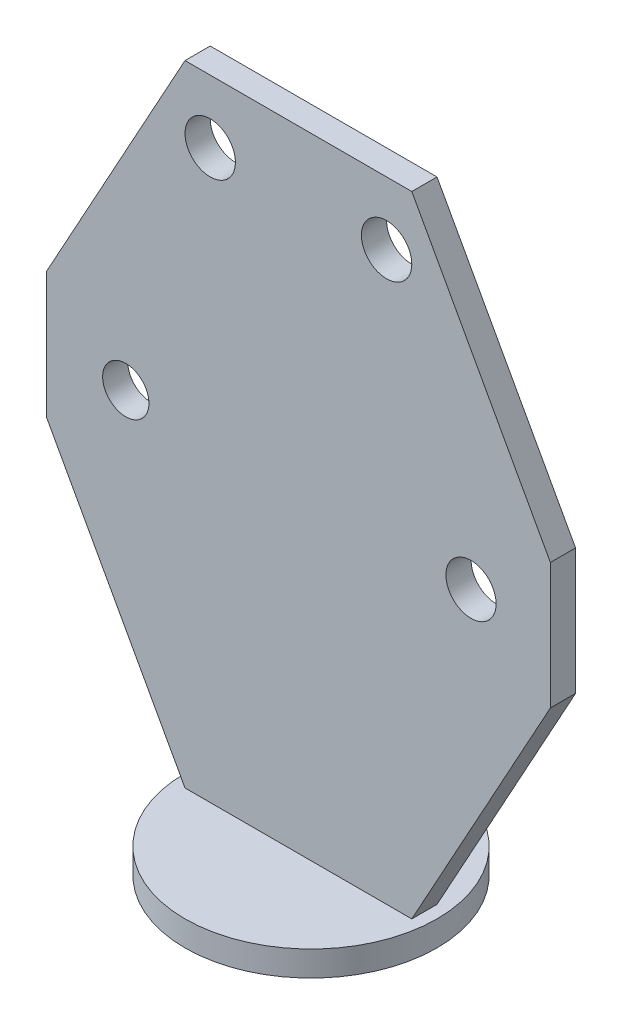
ISO-10303-21;
HEADER;
FILE_DESCRIPTION(('STEP AP214'),'2;1');
FILE_NAME('part.step','',(''),(''),'','','');
FILE_SCHEMA(('AUTOMOTIVE_DESIGN { 1 0 10303 214 1 1 1 1 }'));
ENDSEC;
DATA;
#1=APPLICATION_CONTEXT('core data for automotive mechanical design processes');
#2=APPLICATION_PROTOCOL_DEFINITION('international standard','automotive_design',2000,#1);
#3=PRODUCT_CONTEXT('',#1,'mechanical');
#4=PRODUCT('Part','Part','',(#3));
#5=PRODUCT_RELATED_PRODUCT_CATEGORY('part','',(#4));
#6=PRODUCT_DEFINITION_FORMATION('','',#4);
#7=PRODUCT_DEFINITION_CONTEXT('part definition',#1,'design');
#8=PRODUCT_DEFINITION('design','',#6,#7);
#9=PRODUCT_DEFINITION_SHAPE('','',#8);
#10=(LENGTH_UNIT() NAMED_UNIT(*) SI_UNIT(.MILLI.,.METRE.));
#11=(NAMED_UNIT(*) PLANE_ANGLE_UNIT() SI_UNIT($,.RADIAN.));
#12=(NAMED_UNIT(*) SI_UNIT($,.STERADIAN.) SOLID_ANGLE_UNIT());
#13=UNCERTAINTY_MEASURE_WITH_UNIT(LENGTH_MEASURE(1.E-05),#10,'distance_accuracy_value','');
#14=(GEOMETRIC_REPRESENTATION_CONTEXT(3) GLOBAL_UNCERTAINTY_ASSIGNED_CONTEXT((#13)) GLOBAL_UNIT_ASSIGNED_CONTEXT((#10,
#11,#12)) REPRESENTATION_CONTEXT('',''));
#15=CARTESIAN_POINT('',(0.,0.,0.));
#16=DIRECTION('',(0.,0.,1.));
#17=DIRECTION('',(1.,0.,0.));
#18=AXIS2_PLACEMENT_3D('',#15,#16,#17);
#19=CARTESIAN_POINT('',(0.,2.,0.));
#20=DIRECTION('',(0.,-1.,0.));
#21=DIRECTION('',(0.,0.,-1.));
#22=AXIS2_PLACEMENT_3D('',#19,#20,#21);
#23=CYLINDRICAL_SURFACE('',#22,10.);
#24=CARTESIAN_POINT('',(0.,2.,0.));
#25=DIRECTION('',(0.,1.,0.));
#26=DIRECTION('',(0.,0.,1.));
#27=AXIS2_PLACEMENT_3D('',#24,#25,#26);
#28=CIRCLE('',#27,10.);
#29=CARTESIAN_POINT('',(0.,2.,10.));
#30=VERTEX_POINT('',#29);
#31=EDGE_CURVE('E11',#30,#30,#28,.T.);
#32=ORIENTED_EDGE('',*,*,#31,.F.);
#33=EDGE_LOOP('',(#32));
#34=FACE_BOUND('',#33,.T.);
#35=CARTESIAN_POINT('',(0.,0.,0.));
#36=DIRECTION('',(0.,1.,0.));
#37=DIRECTION('',(0.,0.,1.));
#38=AXIS2_PLACEMENT_3D('',#35,#36,#37);
#39=CIRCLE('',#38,10.);
#40=CARTESIAN_POINT('',(0.,0.,10.));
#41=VERTEX_POINT('',#40);
#42=EDGE_CURVE('E39',#41,#41,#39,.T.);
#43=ORIENTED_EDGE('',*,*,#42,.T.);
#44=EDGE_LOOP('',(#43));
#45=FACE_BOUND('',#44,.T.);
#46=ADVANCED_FACE('F36',(#34,#45),#23,.T.);
#47=CARTESIAN_POINT('',(0.,2.,0.));
#48=DIRECTION('',(0.,1.,0.));
#49=DIRECTION('',(0.,0.,1.));
#50=AXIS2_PLACEMENT_3D('',#47,#48,#49);
#51=PLANE('',#50);
#52=DIRECTION('',(1.,0.,0.));
#53=VECTOR('',#52,1.);
#54=CARTESIAN_POINT('',(9.,2.,-1.));
#55=LINE('',#54,#53);
#56=CARTESIAN_POINT('',(-9.,2.,-1.));
#57=VERTEX_POINT('',#56);
#58=CARTESIAN_POINT('',(9.,2.,-1.));
#59=VERTEX_POINT('',#58);
#60=EDGE_CURVE('E157',#57,#59,#55,.T.);
#61=ORIENTED_EDGE('',*,*,#60,.T.);
#62=DIRECTION('',(0.,0.,1.));
#63=VECTOR('',#62,1.);
#64=CARTESIAN_POINT('',(9.,2.,-1.));
#65=LINE('',#64,#63);
#66=CARTESIAN_POINT('',(9.,2.,1.));
#67=VERTEX_POINT('',#66);
#68=EDGE_CURVE('E178',#59,#67,#65,.T.);
#69=ORIENTED_EDGE('',*,*,#68,.T.);
#70=DIRECTION('',(1.,0.,0.));
#71=VECTOR('',#70,1.);
#72=CARTESIAN_POINT('',(9.,2.,1.));
#73=LINE('',#72,#71);
#74=CARTESIAN_POINT('',(-9.00000000000001,2.,1.));
#75=VERTEX_POINT('',#74);
#76=EDGE_CURVE('E128',#75,#67,#73,.T.);
#77=ORIENTED_EDGE('',*,*,#76,.F.);
#78=DIRECTION('',(0.,0.,1.));
#79=VECTOR('',#78,1.);
#80=CARTESIAN_POINT('',(-9.,2.,-1.));
#81=LINE('',#80,#79);
#82=EDGE_CURVE('E181',#57,#75,#81,.T.);
#83=ORIENTED_EDGE('',*,*,#82,.F.);
#84=EDGE_LOOP('',(#61,#69,#77,#83));
#85=FACE_BOUND('',#84,.T.);
#86=ORIENTED_EDGE('',*,*,#31,.T.);
#87=EDGE_LOOP('',(#86));
#88=FACE_BOUND('',#87,.T.);
#89=ADVANCED_FACE('F189',(#85,#88),#51,.T.);
#90=CARTESIAN_POINT('',(0.,0.,0.));
#91=DIRECTION('',(0.,1.,0.));
#92=DIRECTION('',(0.,0.,1.));
#93=AXIS2_PLACEMENT_3D('',#90,#91,#92);
#94=PLANE('',#93);
#95=ORIENTED_EDGE('',*,*,#42,.F.);
#96=EDGE_LOOP('',(#95));
#97=FACE_BOUND('',#96,.T.);
#98=ADVANCED_FACE('F215',(#97),#94,.F.);
#99=CARTESIAN_POINT('',(-9.00000000000001,52.,-1.));
#100=DIRECTION('',(-0.876215908676647,0.481918749772156,0.));
#101=DIRECTION('',(-0.481918749772156,-0.876215908676647,0.));
#102=AXIS2_PLACEMENT_3D('',#99,#100,#101);
#103=PLANE('',#102);
#104=DIRECTION('',(0.,0.,1.));
#105=VECTOR('',#104,1.);
#106=CARTESIAN_POINT('',(-20.,32.,-1.));
#107=LINE('',#106,#105);
#108=CARTESIAN_POINT('',(-20.,32.,-1.));
#109=VERTEX_POINT('',#108);
#110=CARTESIAN_POINT('',(-20.,32.,1.));
#111=VERTEX_POINT('',#110);
#112=EDGE_CURVE('E99',#109,#111,#107,.T.);
#113=ORIENTED_EDGE('',*,*,#112,.T.);
#114=DIRECTION('',(-0.481918749772156,-0.876215908676647,0.));
#115=VECTOR('',#114,1.);
#116=CARTESIAN_POINT('',(-9.00000000000001,52.,1.));
#117=LINE('',#116,#115);
#118=CARTESIAN_POINT('',(-9.00000000000001,52.,1.));
#119=VERTEX_POINT('',#118);
#120=EDGE_CURVE('E103',#119,#111,#117,.T.);
#121=ORIENTED_EDGE('',*,*,#120,.F.);
#122=DIRECTION('',(0.,0.,1.));
#123=VECTOR('',#122,1.);
#124=CARTESIAN_POINT('',(-9.00000000000001,52.,-1.));
#125=LINE('',#124,#123);
#126=CARTESIAN_POINT('',(-9.00000000000001,52.,-1.));
#127=VERTEX_POINT('',#126);
#128=EDGE_CURVE('E58',#127,#119,#125,.T.);
#129=ORIENTED_EDGE('',*,*,#128,.F.);
#130=DIRECTION('',(-0.481918749772156,-0.876215908676647,0.));
#131=VECTOR('',#130,1.);
#132=CARTESIAN_POINT('',(-9.00000000000001,52.,-1.));
#133=LINE('',#132,#131);
#134=EDGE_CURVE('E104',#127,#109,#133,.T.);
#135=ORIENTED_EDGE('',*,*,#134,.T.);
#136=EDGE_LOOP('',(#113,#121,#129,#135));
#137=FACE_BOUND('',#136,.T.);
#138=ADVANCED_FACE('F101',(#137),#103,.T.);
#139=CARTESIAN_POINT('',(8.99999999999999,52.,-1.));
#140=DIRECTION('',(0.,1.,0.));
#141=DIRECTION('',(-1.,0.,0.));
#142=AXIS2_PLACEMENT_3D('',#139,#140,#141);
#143=PLANE('',#142);
#144=ORIENTED_EDGE('',*,*,#128,.T.);
#145=DIRECTION('',(-1.,0.,0.));
#146=VECTOR('',#145,1.);
#147=CARTESIAN_POINT('',(8.99999999999999,52.,1.));
#148=LINE('',#147,#146);
#149=CARTESIAN_POINT('',(8.99999999999999,52.,1.));
#150=VERTEX_POINT('',#149);
#151=EDGE_CURVE('E119',#150,#119,#148,.T.);
#152=ORIENTED_EDGE('',*,*,#151,.F.);
#153=DIRECTION('',(0.,0.,1.));
#154=VECTOR('',#153,1.);
#155=CARTESIAN_POINT('',(8.99999999999999,52.,-1.));
#156=LINE('',#155,#154);
#157=CARTESIAN_POINT('',(8.99999999999999,52.,-1.));
#158=VERTEX_POINT('',#157);
#159=EDGE_CURVE('E172',#158,#150,#156,.T.);
#160=ORIENTED_EDGE('',*,*,#159,.F.);
#161=DIRECTION('',(-1.,0.,0.));
#162=VECTOR('',#161,1.);
#163=CARTESIAN_POINT('',(8.99999999999999,52.,-1.));
#164=LINE('',#163,#162);
#165=EDGE_CURVE('E109',#158,#127,#164,.T.);
#166=ORIENTED_EDGE('',*,*,#165,.T.);
#167=EDGE_LOOP('',(#144,#152,#160,#166));
#168=FACE_BOUND('',#167,.T.);
#169=ADVANCED_FACE('F207',(#168),#143,.T.);
#170=CARTESIAN_POINT('',(8.99999999999999,52.,-1.));
#171=DIRECTION('',(0.876215908676647,0.481918749772157,0.));
#172=DIRECTION('',(-0.481918749772157,0.876215908676647,0.));
#173=AXIS2_PLACEMENT_3D('',#170,#171,#172);
#174=PLANE('',#173);
#175=ORIENTED_EDGE('',*,*,#159,.T.);
#176=DIRECTION('',(-0.481918749772157,0.876215908676647,0.));
#177=VECTOR('',#176,1.);
#178=CARTESIAN_POINT('',(8.99999999999999,52.,1.));
#179=LINE('',#178,#177);
#180=CARTESIAN_POINT('',(20.,32.,1.));
#181=VERTEX_POINT('',#180);
#182=EDGE_CURVE('E136',#181,#150,#179,.T.);
#183=ORIENTED_EDGE('',*,*,#182,.F.);
#184=DIRECTION('',(0.,0.,1.));
#185=VECTOR('',#184,1.);
#186=CARTESIAN_POINT('',(20.,32.,-1.));
#187=LINE('',#186,#185);
#188=CARTESIAN_POINT('',(20.,32.,-1.));
#189=VERTEX_POINT('',#188);
#190=EDGE_CURVE('E174',#189,#181,#187,.T.);
#191=ORIENTED_EDGE('',*,*,#190,.F.);
#192=DIRECTION('',(-0.481918749772157,0.876215908676647,0.));
#193=VECTOR('',#192,1.);
#194=CARTESIAN_POINT('',(8.99999999999999,52.,-1.));
#195=LINE('',#194,#193);
#196=EDGE_CURVE('E166',#189,#158,#195,.T.);
#197=ORIENTED_EDGE('',*,*,#196,.T.);
#198=EDGE_LOOP('',(#175,#183,#191,#197));
#199=FACE_BOUND('',#198,.T.);
#200=ADVANCED_FACE('F204',(#199),#174,.T.);
#201=CARTESIAN_POINT('',(20.,22.,-1.));
#202=DIRECTION('',(1.,0.,0.));
#203=DIRECTION('',(0.,0.,-1.));
#204=AXIS2_PLACEMENT_3D('',#201,#202,#203);
#205=PLANE('',#204);
#206=ORIENTED_EDGE('',*,*,#190,.T.);
#207=DIRECTION('',(0.,1.,0.));
#208=VECTOR('',#207,1.);
#209=CARTESIAN_POINT('',(20.,22.,1.));
#210=LINE('',#209,#208);
#211=CARTESIAN_POINT('',(20.,22.,1.));
#212=VERTEX_POINT('',#211);
#213=EDGE_CURVE('E133',#212,#181,#210,.T.);
#214=ORIENTED_EDGE('',*,*,#213,.F.);
#215=DIRECTION('',(0.,0.,1.));
#216=VECTOR('',#215,1.);
#217=CARTESIAN_POINT('',(20.,22.,-1.));
#218=LINE('',#217,#216);
#219=CARTESIAN_POINT('',(20.,22.,-1.));
#220=VERTEX_POINT('',#219);
#221=EDGE_CURVE('E176',#220,#212,#218,.T.);
#222=ORIENTED_EDGE('',*,*,#221,.F.);
#223=DIRECTION('',(0.,1.,0.));
#224=VECTOR('',#223,1.);
#225=CARTESIAN_POINT('',(20.,22.,-1.));
#226=LINE('',#225,#224);
#227=EDGE_CURVE('E163',#220,#189,#226,.T.);
#228=ORIENTED_EDGE('',*,*,#227,.T.);
#229=EDGE_LOOP('',(#206,#214,#222,#228));
#230=FACE_BOUND('',#229,.T.);
#231=ADVANCED_FACE('F198',(#230),#205,.T.);
#232=CARTESIAN_POINT('',(20.,22.,-1.));
#233=DIRECTION('',(0.876215908676647,-0.481918749772156,0.));
#234=DIRECTION('',(0.481918749772156,0.876215908676647,0.));
#235=AXIS2_PLACEMENT_3D('',#232,#233,#234);
#236=PLANE('',#235);
#237=ORIENTED_EDGE('',*,*,#221,.T.);
#238=DIRECTION('',(0.481918749772156,0.876215908676647,0.));
#239=VECTOR('',#238,1.);
#240=CARTESIAN_POINT('',(20.,22.,1.));
#241=LINE('',#240,#239);
#242=EDGE_CURVE('E130',#67,#212,#241,.T.);
#243=ORIENTED_EDGE('',*,*,#242,.F.);
#244=ORIENTED_EDGE('',*,*,#68,.F.);
#245=DIRECTION('',(0.481918749772156,0.876215908676647,0.));
#246=VECTOR('',#245,1.);
#247=CARTESIAN_POINT('',(20.,22.,-1.));
#248=LINE('',#247,#246);
#249=EDGE_CURVE('E160',#59,#220,#248,.T.);
#250=ORIENTED_EDGE('',*,*,#249,.T.);
#251=EDGE_LOOP('',(#237,#243,#244,#250));
#252=FACE_BOUND('',#251,.T.);
#253=ADVANCED_FACE('F194',(#252),#236,.T.);
#254=CARTESIAN_POINT('',(-20.,22.,-1.));
#255=DIRECTION('',(-0.876215908676647,-0.481918749772156,0.));
#256=DIRECTION('',(0.481918749772156,-0.876215908676647,0.));
#257=AXIS2_PLACEMENT_3D('',#254,#255,#256);
#258=PLANE('',#257);
#259=ORIENTED_EDGE('',*,*,#82,.T.);
#260=DIRECTION('',(0.481918749772156,-0.876215908676647,0.));
#261=VECTOR('',#260,1.);
#262=CARTESIAN_POINT('',(-20.,22.,1.));
#263=LINE('',#262,#261);
#264=CARTESIAN_POINT('',(-20.,22.,1.));
#265=VERTEX_POINT('',#264);
#266=EDGE_CURVE('E50',#265,#75,#263,.T.);
#267=ORIENTED_EDGE('',*,*,#266,.F.);
#268=DIRECTION('',(0.,0.,1.));
#269=VECTOR('',#268,1.);
#270=CARTESIAN_POINT('',(-20.,22.,-1.));
#271=LINE('',#270,#269);
#272=CARTESIAN_POINT('',(-20.,22.,-1.));
#273=VERTEX_POINT('',#272);
#274=EDGE_CURVE('E108',#273,#265,#271,.T.);
#275=ORIENTED_EDGE('',*,*,#274,.F.);
#276=DIRECTION('',(0.481918749772156,-0.876215908676647,0.));
#277=VECTOR('',#276,1.);
#278=CARTESIAN_POINT('',(-20.,22.,-1.));
#279=LINE('',#278,#277);
#280=EDGE_CURVE('E154',#273,#57,#279,.T.);
#281=ORIENTED_EDGE('',*,*,#280,.T.);
#282=EDGE_LOOP('',(#259,#267,#275,#281));
#283=FACE_BOUND('',#282,.T.);
#284=ADVANCED_FACE('F186',(#283),#258,.T.);
#285=CARTESIAN_POINT('',(-20.,22.,-1.));
#286=DIRECTION('',(-1.,0.,0.));
#287=DIRECTION('',(0.,0.,1.));
#288=AXIS2_PLACEMENT_3D('',#285,#286,#287);
#289=PLANE('',#288);
#290=ORIENTED_EDGE('',*,*,#274,.T.);
#291=DIRECTION('',(0.,-1.,0.));
#292=VECTOR('',#291,1.);
#293=CARTESIAN_POINT('',(-20.,22.,1.));
#294=LINE('',#293,#292);
#295=EDGE_CURVE('E111',#111,#265,#294,.T.);
#296=ORIENTED_EDGE('',*,*,#295,.F.);
#297=ORIENTED_EDGE('',*,*,#112,.F.);
#298=DIRECTION('',(0.,-1.,0.));
#299=VECTOR('',#298,1.);
#300=CARTESIAN_POINT('',(-20.,22.,-1.));
#301=LINE('',#300,#299);
#302=EDGE_CURVE('E152',#109,#273,#301,.T.);
#303=ORIENTED_EDGE('',*,*,#302,.T.);
#304=EDGE_LOOP('',(#290,#296,#297,#303));
#305=FACE_BOUND('',#304,.T.);
#306=ADVANCED_FACE('F112',(#305),#289,.T.);
#307=CARTESIAN_POINT('',(0.,0.,-1.));
#308=DIRECTION('',(0.,0.,-1.));
#309=DIRECTION('',(-1.,0.,0.));
#310=AXIS2_PLACEMENT_3D('',#307,#308,#309);
#311=PLANE('',#310);
#312=CARTESIAN_POINT('',(-13.7,27.,-1.));
#313=DIRECTION('',(0.,0.,1.));
#314=DIRECTION('',(1.,0.,0.));
#315=AXIS2_PLACEMENT_3D('',#312,#313,#314);
#316=CIRCLE('',#315,1.83666767318952);
#317=CARTESIAN_POINT('',(-11.8633323268105,27.,-1.));
#318=VERTEX_POINT('',#317);
#319=EDGE_CURVE('E139',#318,#318,#316,.T.);
#320=ORIENTED_EDGE('',*,*,#319,.T.);
#321=EDGE_LOOP('',(#320));
#322=FACE_BOUND('',#321,.T.);
#323=CARTESIAN_POINT('',(13.7,27.,-1.));
#324=DIRECTION('',(0.,0.,1.));
#325=DIRECTION('',(1.,0.,0.));
#326=AXIS2_PLACEMENT_3D('',#323,#324,#325);
#327=CIRCLE('',#326,1.99244063637216);
#328=CARTESIAN_POINT('',(15.6924406363722,27.,-1.));
#329=VERTEX_POINT('',#328);
#330=EDGE_CURVE('E142',#329,#329,#327,.T.);
#331=ORIENTED_EDGE('',*,*,#330,.T.);
#332=EDGE_LOOP('',(#331));
#333=FACE_BOUND('',#332,.T.);
#334=CARTESIAN_POINT('',(7.,47.,-1.));
#335=DIRECTION('',(0.,0.,1.));
#336=DIRECTION('',(1.,0.,0.));
#337=AXIS2_PLACEMENT_3D('',#334,#335,#336);
#338=CIRCLE('',#337,2.);
#339=CARTESIAN_POINT('',(9.,47.,-1.));
#340=VERTEX_POINT('',#339);
#341=EDGE_CURVE('E145',#340,#340,#338,.T.);
#342=ORIENTED_EDGE('',*,*,#341,.T.);
#343=EDGE_LOOP('',(#342));
#344=FACE_BOUND('',#343,.T.);
#345=CARTESIAN_POINT('',(-7.,47.,-1.));
#346=DIRECTION('',(0.,0.,1.));
#347=DIRECTION('',(1.,0.,0.));
#348=AXIS2_PLACEMENT_3D('',#345,#346,#347);
#349=CIRCLE('',#348,2.);
#350=CARTESIAN_POINT('',(-5.,47.,-1.));
#351=VERTEX_POINT('',#350);
#352=EDGE_CURVE('E148',#351,#351,#349,.T.);
#353=ORIENTED_EDGE('',*,*,#352,.T.);
#354=EDGE_LOOP('',(#353));
#355=FACE_BOUND('',#354,.T.);
#356=ORIENTED_EDGE('',*,*,#134,.F.);
#357=ORIENTED_EDGE('',*,*,#165,.F.);
#358=ORIENTED_EDGE('',*,*,#196,.F.);
#359=ORIENTED_EDGE('',*,*,#227,.F.);
#360=ORIENTED_EDGE('',*,*,#249,.F.);
#361=ORIENTED_EDGE('',*,*,#60,.F.);
#362=ORIENTED_EDGE('',*,*,#280,.F.);
#363=ORIENTED_EDGE('',*,*,#302,.F.);
#364=EDGE_LOOP('',(#356,#357,#358,#359,#360,#361,#362,#363));
#365=FACE_BOUND('',#364,.T.);
#366=ADVANCED_FACE('F201',(#322,#333,#344,#355,#365),#311,.T.);
#367=CARTESIAN_POINT('',(-7.,47.,-1.));
#368=DIRECTION('',(0.,0.,1.));
#369=DIRECTION('',(1.,0.,0.));
#370=AXIS2_PLACEMENT_3D('',#367,#368,#369);
#371=CYLINDRICAL_SURFACE('',#370,2.);
#372=ORIENTED_EDGE('',*,*,#352,.F.);
#373=EDGE_LOOP('',(#372));
#374=FACE_BOUND('',#373,.T.);
#375=CARTESIAN_POINT('',(-7.,47.,1.));
#376=DIRECTION('',(0.,0.,1.));
#377=DIRECTION('',(1.,0.,0.));
#378=AXIS2_PLACEMENT_3D('',#375,#376,#377);
#379=CIRCLE('',#378,2.);
#380=CARTESIAN_POINT('',(-5.,47.,1.));
#381=VERTEX_POINT('',#380);
#382=EDGE_CURVE('E120',#381,#381,#379,.T.);
#383=ORIENTED_EDGE('',*,*,#382,.T.);
#384=EDGE_LOOP('',(#383));
#385=FACE_BOUND('',#384,.T.);
#386=ADVANCED_FACE('F262',(#374,#385),#371,.F.);
#387=CARTESIAN_POINT('',(7.,47.,-1.));
#388=DIRECTION('',(0.,0.,1.));
#389=DIRECTION('',(1.,0.,0.));
#390=AXIS2_PLACEMENT_3D('',#387,#388,#389);
#391=CYLINDRICAL_SURFACE('',#390,2.);
#392=ORIENTED_EDGE('',*,*,#341,.F.);
#393=EDGE_LOOP('',(#392));
#394=FACE_BOUND('',#393,.T.);
#395=CARTESIAN_POINT('',(7.,47.,1.));
#396=DIRECTION('',(0.,0.,1.));
#397=DIRECTION('',(1.,0.,0.));
#398=AXIS2_PLACEMENT_3D('',#395,#396,#397);
#399=CIRCLE('',#398,2.);
#400=CARTESIAN_POINT('',(9.,47.,1.));
#401=VERTEX_POINT('',#400);
#402=EDGE_CURVE('E123',#401,#401,#399,.T.);
#403=ORIENTED_EDGE('',*,*,#402,.T.);
#404=EDGE_LOOP('',(#403));
#405=FACE_BOUND('',#404,.T.);
#406=ADVANCED_FACE('F269',(#394,#405),#391,.F.);
#407=CARTESIAN_POINT('',(13.7,27.,-1.));
#408=DIRECTION('',(0.,0.,1.));
#409=DIRECTION('',(1.,0.,0.));
#410=AXIS2_PLACEMENT_3D('',#407,#408,#409);
#411=CYLINDRICAL_SURFACE('',#410,1.99244063637216);
#412=ORIENTED_EDGE('',*,*,#330,.F.);
#413=EDGE_LOOP('',(#412));
#414=FACE_BOUND('',#413,.T.);
#415=CARTESIAN_POINT('',(13.7,27.,1.));
#416=DIRECTION('',(0.,0.,1.));
#417=DIRECTION('',(1.,0.,0.));
#418=AXIS2_PLACEMENT_3D('',#415,#416,#417);
#419=CIRCLE('',#418,1.99244063637216);
#420=CARTESIAN_POINT('',(15.6924406363722,27.,1.));
#421=VERTEX_POINT('',#420);
#422=EDGE_CURVE('E356',#421,#421,#419,.T.);
#423=ORIENTED_EDGE('',*,*,#422,.T.);
#424=EDGE_LOOP('',(#423));
#425=FACE_BOUND('',#424,.T.);
#426=ADVANCED_FACE('F277',(#414,#425),#411,.F.);
#427=CARTESIAN_POINT('',(-13.7,27.,-1.));
#428=DIRECTION('',(0.,0.,1.));
#429=DIRECTION('',(1.,0.,0.));
#430=AXIS2_PLACEMENT_3D('',#427,#428,#429);
#431=CYLINDRICAL_SURFACE('',#430,1.83666767318952);
#432=ORIENTED_EDGE('',*,*,#319,.F.);
#433=EDGE_LOOP('',(#432));
#434=FACE_BOUND('',#433,.T.);
#435=CARTESIAN_POINT('',(-13.7,27.,1.));
#436=DIRECTION('',(0.,0.,1.));
#437=DIRECTION('',(1.,0.,0.));
#438=AXIS2_PLACEMENT_3D('',#435,#436,#437);
#439=CIRCLE('',#438,1.83666767318952);
#440=CARTESIAN_POINT('',(-11.8633323268105,27.,1.));
#441=VERTEX_POINT('',#440);
#442=EDGE_CURVE('E354',#441,#441,#439,.T.);
#443=ORIENTED_EDGE('',*,*,#442,.T.);
#444=EDGE_LOOP('',(#443));
#445=FACE_BOUND('',#444,.T.);
#446=ADVANCED_FACE('F285',(#434,#445),#431,.F.);
#447=CARTESIAN_POINT('',(0.,0.,1.));
#448=DIRECTION('',(0.,0.,-1.));
#449=DIRECTION('',(-1.,0.,0.));
#450=AXIS2_PLACEMENT_3D('',#447,#448,#449);
#451=PLANE('',#450);
#452=ORIENTED_EDGE('',*,*,#120,.T.);
#453=ORIENTED_EDGE('',*,*,#295,.T.);
#454=ORIENTED_EDGE('',*,*,#266,.T.);
#455=ORIENTED_EDGE('',*,*,#76,.T.);
#456=ORIENTED_EDGE('',*,*,#242,.T.);
#457=ORIENTED_EDGE('',*,*,#213,.T.);
#458=ORIENTED_EDGE('',*,*,#182,.T.);
#459=ORIENTED_EDGE('',*,*,#151,.T.);
#460=EDGE_LOOP('',(#452,#453,#454,#455,#456,#457,#458,#459));
#461=FACE_BOUND('',#460,.T.);
#462=ORIENTED_EDGE('',*,*,#382,.F.);
#463=EDGE_LOOP('',(#462));
#464=FACE_BOUND('',#463,.T.);
#465=ORIENTED_EDGE('',*,*,#402,.F.);
#466=EDGE_LOOP('',(#465));
#467=FACE_BOUND('',#466,.T.);
#468=ORIENTED_EDGE('',*,*,#422,.F.);
#469=EDGE_LOOP('',(#468));
#470=FACE_BOUND('',#469,.T.);
#471=ORIENTED_EDGE('',*,*,#442,.F.);
#472=EDGE_LOOP('',(#471));
#473=FACE_BOUND('',#472,.T.);
#474=ADVANCED_FACE('F115',(#461,#464,#467,#470,#473),#451,.F.);
#475=CLOSED_SHELL('',(#46,#89,#98,#138,#169,#200,#231,#253,#284,#306,#366,#386,#406,#426,#446,#474));
#476=MANIFOLD_SOLID_BREP('B2',#475);
#477=ADVANCED_BREP_SHAPE_REPRESENTATION('',(#18,#476),#14);
#478=SHAPE_DEFINITION_REPRESENTATION(#9,#477);
ENDSEC;
END-ISO-10303-21;
